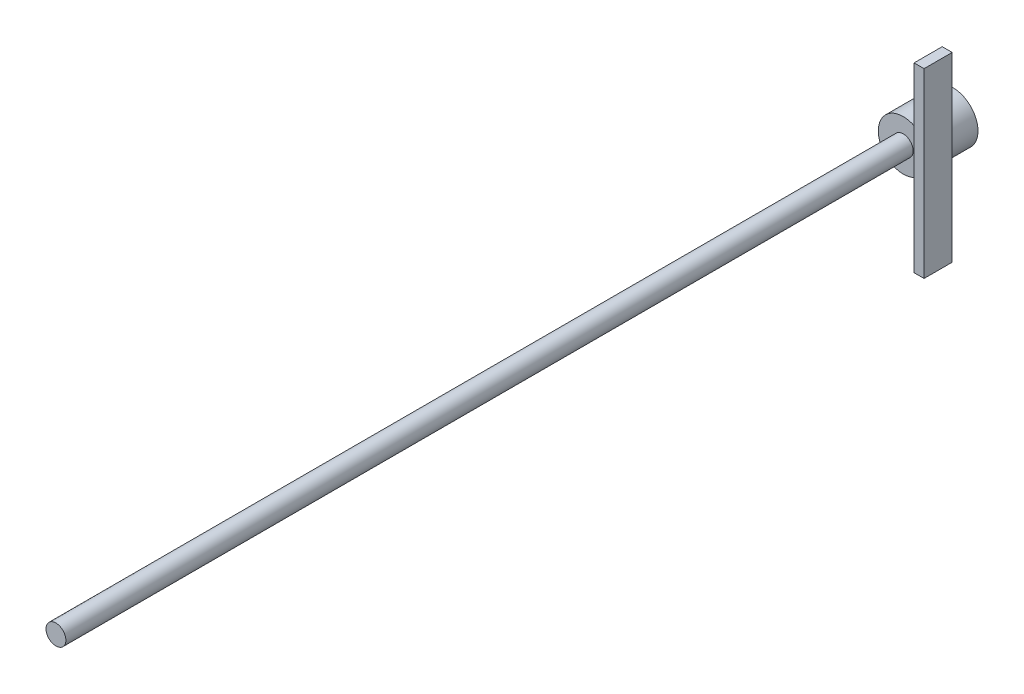
ISO-10303-21;
HEADER;
FILE_DESCRIPTION(('STEP AP214'),'2;1');
FILE_NAME('part.step','',(''),(''),'','','');
FILE_SCHEMA(('AUTOMOTIVE_DESIGN { 1 0 10303 214 1 1 1 1 }'));
ENDSEC;
DATA;
#1=APPLICATION_CONTEXT('core data for automotive mechanical design processes');
#2=APPLICATION_PROTOCOL_DEFINITION('international standard','automotive_design',2000,#1);
#3=PRODUCT_CONTEXT('',#1,'mechanical');
#4=PRODUCT('Part','Part','',(#3));
#5=PRODUCT_RELATED_PRODUCT_CATEGORY('part','',(#4));
#6=PRODUCT_DEFINITION_FORMATION('','',#4);
#7=PRODUCT_DEFINITION_CONTEXT('part definition',#1,'design');
#8=PRODUCT_DEFINITION('design','',#6,#7);
#9=PRODUCT_DEFINITION_SHAPE('','',#8);
#10=(LENGTH_UNIT() NAMED_UNIT(*) SI_UNIT(.MILLI.,.METRE.));
#11=(NAMED_UNIT(*) PLANE_ANGLE_UNIT() SI_UNIT($,.RADIAN.));
#12=(NAMED_UNIT(*) SI_UNIT($,.STERADIAN.) SOLID_ANGLE_UNIT());
#13=UNCERTAINTY_MEASURE_WITH_UNIT(LENGTH_MEASURE(1.E-05),#10,'distance_accuracy_value','');
#14=(GEOMETRIC_REPRESENTATION_CONTEXT(3) GLOBAL_UNCERTAINTY_ASSIGNED_CONTEXT((#13)) GLOBAL_UNIT_ASSIGNED_CONTEXT((#10,
#11,#12)) REPRESENTATION_CONTEXT('',''));
#15=CARTESIAN_POINT('',(0.,0.,0.));
#16=DIRECTION('',(0.,0.,1.));
#17=DIRECTION('',(1.,0.,0.));
#18=AXIS2_PLACEMENT_3D('',#15,#16,#17);
#19=CARTESIAN_POINT('',(3.5,-9.11594568816165,6.40942583317208));
#20=DIRECTION('',(0.,0.,-1.));
#21=DIRECTION('',(-1.,0.,0.));
#22=AXIS2_PLACEMENT_3D('',#19,#20,#21);
#23=PLANE('',#22);
#24=DIRECTION('',(0.,-1.,0.));
#25=VECTOR('',#24,1.);
#26=CARTESIAN_POINT('',(2.5,-9.11594568816165,6.40942583317208));
#27=LINE('',#26,#25);
#28=CARTESIAN_POINT('',(2.5,9.11594568816165,6.40942583317208));
#29=VERTEX_POINT('',#28);
#30=CARTESIAN_POINT('',(2.5,-9.11594568816165,6.40942583317208));
#31=VERTEX_POINT('',#30);
#32=EDGE_CURVE('E104',#29,#31,#27,.T.);
#33=ORIENTED_EDGE('',*,*,#32,.T.);
#34=DIRECTION('',(-1.,0.,0.));
#35=VECTOR('',#34,1.);
#36=CARTESIAN_POINT('',(3.5,-9.11594568816165,6.40942583317208));
#37=LINE('',#36,#35);
#38=CARTESIAN_POINT('',(3.5,-9.11594568816165,6.40942583317208));
#39=VERTEX_POINT('',#38);
#40=EDGE_CURVE('E12',#39,#31,#37,.T.);
#41=ORIENTED_EDGE('',*,*,#40,.F.);
#42=DIRECTION('',(0.,-1.,0.));
#43=VECTOR('',#42,1.);
#44=CARTESIAN_POINT('',(3.5,-9.11594568816165,6.40942583317208));
#45=LINE('',#44,#43);
#46=CARTESIAN_POINT('',(3.5,9.11594568816165,6.40942583317208));
#47=VERTEX_POINT('',#46);
#48=EDGE_CURVE('E92',#47,#39,#45,.T.);
#49=ORIENTED_EDGE('',*,*,#48,.F.);
#50=DIRECTION('',(-1.,0.,0.));
#51=VECTOR('',#50,1.);
#52=CARTESIAN_POINT('',(3.5,9.11594568816165,6.40942583317208));
#53=LINE('',#52,#51);
#54=EDGE_CURVE('E100',#47,#29,#53,.T.);
#55=ORIENTED_EDGE('',*,*,#54,.T.);
#56=EDGE_LOOP('',(#33,#41,#49,#55));
#57=FACE_BOUND('',#56,.T.);
#58=ADVANCED_FACE('F41',(#57),#23,.F.);
#59=CARTESIAN_POINT('',(3.5,-9.11594568816165,3.59057416682792));
#60=DIRECTION('',(0.,1.,0.));
#61=DIRECTION('',(0.,0.,1.));
#62=AXIS2_PLACEMENT_3D('',#59,#60,#61);
#63=PLANE('',#62);
#64=DIRECTION('',(0.,0.,-1.));
#65=VECTOR('',#64,1.);
#66=CARTESIAN_POINT('',(2.5,-9.11594568816165,3.59057416682792));
#67=LINE('',#66,#65);
#68=CARTESIAN_POINT('',(2.5,-9.11594568816165,3.59057416682792));
#69=VERTEX_POINT('',#68);
#70=EDGE_CURVE('E96',#31,#69,#67,.T.);
#71=ORIENTED_EDGE('',*,*,#70,.T.);
#72=DIRECTION('',(-1.,0.,0.));
#73=VECTOR('',#72,1.);
#74=CARTESIAN_POINT('',(3.5,-9.11594568816165,3.59057416682792));
#75=LINE('',#74,#73);
#76=CARTESIAN_POINT('',(3.5,-9.11594568816165,3.59057416682792));
#77=VERTEX_POINT('',#76);
#78=EDGE_CURVE('E49',#77,#69,#75,.T.);
#79=ORIENTED_EDGE('',*,*,#78,.F.);
#80=DIRECTION('',(0.,0.,-1.));
#81=VECTOR('',#80,1.);
#82=CARTESIAN_POINT('',(3.5,-9.11594568816165,3.59057416682792));
#83=LINE('',#82,#81);
#84=EDGE_CURVE('E87',#39,#77,#83,.T.);
#85=ORIENTED_EDGE('',*,*,#84,.F.);
#86=ORIENTED_EDGE('',*,*,#40,.T.);
#87=EDGE_LOOP('',(#71,#79,#85,#86));
#88=FACE_BOUND('',#87,.T.);
#89=ADVANCED_FACE('F95',(#88),#63,.F.);
#90=CARTESIAN_POINT('',(3.5,-9.11594568816165,3.59057416682792));
#91=DIRECTION('',(0.,0.,1.));
#92=DIRECTION('',(1.,0.,0.));
#93=AXIS2_PLACEMENT_3D('',#90,#91,#92);
#94=PLANE('',#93);
#95=DIRECTION('',(0.,1.,0.));
#96=VECTOR('',#95,1.);
#97=CARTESIAN_POINT('',(2.5,-9.11594568816165,3.59057416682792));
#98=LINE('',#97,#96);
#99=CARTESIAN_POINT('',(2.5,9.11594568816165,3.59057416682792));
#100=VERTEX_POINT('',#99);
#101=EDGE_CURVE('E74',#69,#100,#98,.T.);
#102=ORIENTED_EDGE('',*,*,#101,.T.);
#103=DIRECTION('',(-1.,0.,0.));
#104=VECTOR('',#103,1.);
#105=CARTESIAN_POINT('',(3.5,9.11594568816165,3.59057416682792));
#106=LINE('',#105,#104);
#107=CARTESIAN_POINT('',(3.5,9.11594568816165,3.59057416682792));
#108=VERTEX_POINT('',#107);
#109=EDGE_CURVE('E97',#108,#100,#106,.T.);
#110=ORIENTED_EDGE('',*,*,#109,.F.);
#111=DIRECTION('',(0.,1.,0.));
#112=VECTOR('',#111,1.);
#113=CARTESIAN_POINT('',(3.5,-9.11594568816165,3.59057416682792));
#114=LINE('',#113,#112);
#115=EDGE_CURVE('E90',#77,#108,#114,.T.);
#116=ORIENTED_EDGE('',*,*,#115,.F.);
#117=ORIENTED_EDGE('',*,*,#78,.T.);
#118=EDGE_LOOP('',(#102,#110,#116,#117));
#119=FACE_BOUND('',#118,.T.);
#120=ADVANCED_FACE('F98',(#119),#94,.F.);
#121=CARTESIAN_POINT('',(3.5,9.11594568816165,3.59057416682792));
#122=DIRECTION('',(0.,-1.,0.));
#123=DIRECTION('',(0.,0.,-1.));
#124=AXIS2_PLACEMENT_3D('',#121,#122,#123);
#125=PLANE('',#124);
#126=DIRECTION('',(0.,0.,1.));
#127=VECTOR('',#126,1.);
#128=CARTESIAN_POINT('',(2.5,9.11594568816165,3.59057416682792));
#129=LINE('',#128,#127);
#130=EDGE_CURVE('E80',#100,#29,#129,.T.);
#131=ORIENTED_EDGE('',*,*,#130,.T.);
#132=ORIENTED_EDGE('',*,*,#54,.F.);
#133=DIRECTION('',(0.,0.,1.));
#134=VECTOR('',#133,1.);
#135=CARTESIAN_POINT('',(3.5,9.11594568816165,3.59057416682792));
#136=LINE('',#135,#134);
#137=EDGE_CURVE('E57',#108,#47,#136,.T.);
#138=ORIENTED_EDGE('',*,*,#137,.F.);
#139=ORIENTED_EDGE('',*,*,#109,.T.);
#140=EDGE_LOOP('',(#131,#132,#138,#139));
#141=FACE_BOUND('',#140,.T.);
#142=ADVANCED_FACE('F111',(#141),#125,.F.);
#143=CARTESIAN_POINT('',(3.5,0.,0.));
#144=DIRECTION('',(1.,0.,0.));
#145=DIRECTION('',(0.,0.,-1.));
#146=AXIS2_PLACEMENT_3D('',#143,#144,#145);
#147=PLANE('',#146);
#148=ORIENTED_EDGE('',*,*,#48,.T.);
#149=ORIENTED_EDGE('',*,*,#84,.T.);
#150=ORIENTED_EDGE('',*,*,#115,.T.);
#151=ORIENTED_EDGE('',*,*,#137,.T.);
#152=EDGE_LOOP('',(#148,#149,#150,#151));
#153=FACE_BOUND('',#152,.T.);
#154=ADVANCED_FACE('F88',(#153),#147,.T.);
#155=CARTESIAN_POINT('',(2.5,0.,0.));
#156=DIRECTION('',(1.,0.,0.));
#157=DIRECTION('',(0.,0.,-1.));
#158=AXIS2_PLACEMENT_3D('',#155,#156,#157);
#159=PLANE('',#158);
#160=ORIENTED_EDGE('',*,*,#32,.F.);
#161=ORIENTED_EDGE('',*,*,#130,.F.);
#162=ORIENTED_EDGE('',*,*,#101,.F.);
#163=ORIENTED_EDGE('',*,*,#70,.F.);
#164=EDGE_LOOP('',(#160,#161,#162,#163));
#165=FACE_BOUND('',#164,.T.);
#166=ADVANCED_FACE('F114',(#165),#159,.F.);
#167=CLOSED_SHELL('',(#58,#89,#120,#142,#154,#166));
#168=MANIFOLD_SOLID_BREP('B2',#167);
#169=CARTESIAN_POINT('',(0.,0.,5.));
#170=DIRECTION('',(0.,0.,-1.));
#171=DIRECTION('',(-1.,0.,0.));
#172=AXIS2_PLACEMENT_3D('',#169,#170,#171);
#173=CYLINDRICAL_SURFACE('',#172,2.5);
#174=CARTESIAN_POINT('',(0.,0.,5.));
#175=DIRECTION('',(0.,0.,1.));
#176=DIRECTION('',(1.,0.,0.));
#177=AXIS2_PLACEMENT_3D('',#174,#175,#176);
#178=CIRCLE('',#177,2.5);
#179=CARTESIAN_POINT('',(2.5,0.,5.));
#180=VERTEX_POINT('',#179);
#181=EDGE_CURVE('E40',#180,#180,#178,.T.);
#182=ORIENTED_EDGE('',*,*,#181,.F.);
#183=EDGE_LOOP('',(#182));
#184=FACE_BOUND('',#183,.T.);
#185=CARTESIAN_POINT('',(0.,0.,0.));
#186=DIRECTION('',(0.,0.,1.));
#187=DIRECTION('',(1.,0.,0.));
#188=AXIS2_PLACEMENT_3D('',#185,#186,#187);
#189=CIRCLE('',#188,2.5);
#190=CARTESIAN_POINT('',(2.5,0.,0.));
#191=VERTEX_POINT('',#190);
#192=EDGE_CURVE('E168',#191,#191,#189,.T.);
#193=ORIENTED_EDGE('',*,*,#192,.T.);
#194=EDGE_LOOP('',(#193));
#195=FACE_BOUND('',#194,.T.);
#196=ADVANCED_FACE('F165',(#184,#195),#173,.T.);
#197=CARTESIAN_POINT('',(0.,0.,5.));
#198=DIRECTION('',(0.,0.,1.));
#199=DIRECTION('',(1.,0.,0.));
#200=AXIS2_PLACEMENT_3D('',#197,#198,#199);
#201=PLANE('',#200);
#202=CARTESIAN_POINT('',(0.,0.,5.));
#203=DIRECTION('',(0.,0.,1.));
#204=DIRECTION('',(1.,0.,0.));
#205=AXIS2_PLACEMENT_3D('',#202,#203,#204);
#206=CIRCLE('',#205,0.997360314797742);
#207=CARTESIAN_POINT('',(0.997360314797742,0.,5.));
#208=VERTEX_POINT('',#207);
#209=EDGE_CURVE('E175',#208,#208,#206,.F.);
#210=ORIENTED_EDGE('',*,*,#209,.T.);
#211=EDGE_LOOP('',(#210));
#212=FACE_BOUND('',#211,.T.);
#213=ORIENTED_EDGE('',*,*,#181,.T.);
#214=EDGE_LOOP('',(#213));
#215=FACE_BOUND('',#214,.T.);
#216=ADVANCED_FACE('F195',(#212,#215),#201,.T.);
#217=CARTESIAN_POINT('',(0.,0.,0.));
#218=DIRECTION('',(0.,0.,1.));
#219=DIRECTION('',(1.,0.,0.));
#220=AXIS2_PLACEMENT_3D('',#217,#218,#219);
#221=PLANE('',#220);
#222=ORIENTED_EDGE('',*,*,#192,.F.);
#223=EDGE_LOOP('',(#222));
#224=FACE_BOUND('',#223,.T.);
#225=ADVANCED_FACE('F187',(#224),#221,.F.);
#226=CARTESIAN_POINT('',(0.,0.,90.));
#227=DIRECTION('',(0.,0.,-1.));
#228=DIRECTION('',(-1.,0.,0.));
#229=AXIS2_PLACEMENT_3D('',#226,#227,#228);
#230=CYLINDRICAL_SURFACE('',#229,0.997360314797742);
#231=ORIENTED_EDGE('',*,*,#209,.F.);
#232=EDGE_LOOP('',(#231));
#233=FACE_BOUND('',#232,.T.);
#234=CARTESIAN_POINT('',(0.,0.,90.));
#235=DIRECTION('',(0.,0.,1.));
#236=DIRECTION('',(1.,0.,0.));
#237=AXIS2_PLACEMENT_3D('',#234,#235,#236);
#238=CIRCLE('',#237,0.997360314797742);
#239=CARTESIAN_POINT('',(0.997360314797742,0.,90.));
#240=VERTEX_POINT('',#239);
#241=EDGE_CURVE('E179',#240,#240,#238,.T.);
#242=ORIENTED_EDGE('',*,*,#241,.F.);
#243=EDGE_LOOP('',(#242));
#244=FACE_BOUND('',#243,.T.);
#245=ADVANCED_FACE('F185',(#233,#244),#230,.T.);
#246=CARTESIAN_POINT('',(0.,0.,90.));
#247=DIRECTION('',(0.,0.,1.));
#248=DIRECTION('',(1.,0.,0.));
#249=AXIS2_PLACEMENT_3D('',#246,#247,#248);
#250=PLANE('',#249);
#251=ORIENTED_EDGE('',*,*,#241,.T.);
#252=EDGE_LOOP('',(#251));
#253=FACE_BOUND('',#252,.T.);
#254=ADVANCED_FACE('F183',(#253),#250,.T.);
#255=CLOSED_SHELL('',(#196,#216,#225,#245,#254));
#256=MANIFOLD_SOLID_BREP('B6',#255);
#257=ADVANCED_BREP_SHAPE_REPRESENTATION('',(#18,#168,#256),#14);
#258=SHAPE_DEFINITION_REPRESENTATION(#9,#257);
ENDSEC;
END-ISO-10303-21;
